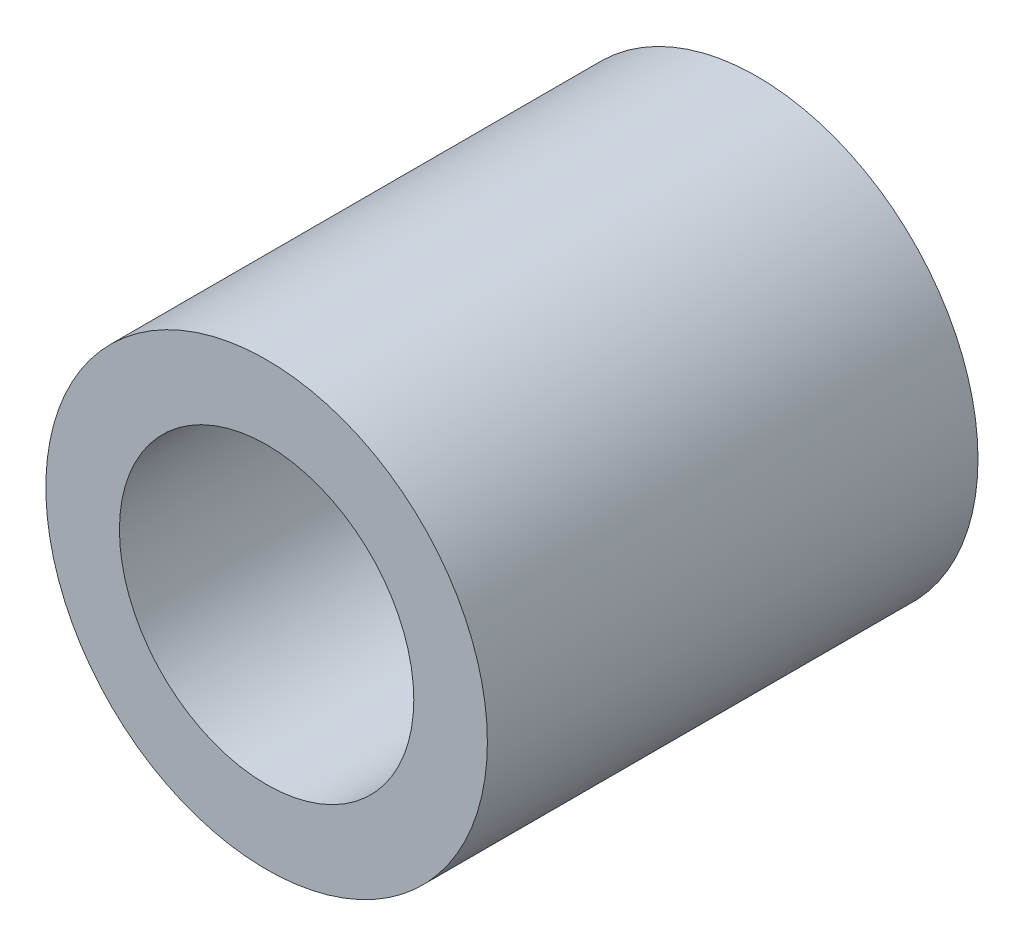
ISO-10303-21;
HEADER;
FILE_DESCRIPTION(('STEP AP214'),'2;1');
FILE_NAME('part.step','',(''),(''),'','','');
FILE_SCHEMA(('AUTOMOTIVE_DESIGN { 1 0 10303 214 1 1 1 1 }'));
ENDSEC;
DATA;
#1=APPLICATION_CONTEXT('core data for automotive mechanical design processes');
#2=APPLICATION_PROTOCOL_DEFINITION('international standard','automotive_design',2000,#1);
#3=PRODUCT_CONTEXT('',#1,'mechanical');
#4=PRODUCT('Part','Part','',(#3));
#5=PRODUCT_RELATED_PRODUCT_CATEGORY('part','',(#4));
#6=PRODUCT_DEFINITION_FORMATION('','',#4);
#7=PRODUCT_DEFINITION_CONTEXT('part definition',#1,'design');
#8=PRODUCT_DEFINITION('design','',#6,#7);
#9=PRODUCT_DEFINITION_SHAPE('','',#8);
#10=(LENGTH_UNIT() NAMED_UNIT(*) SI_UNIT(.MILLI.,.METRE.));
#11=(NAMED_UNIT(*) PLANE_ANGLE_UNIT() SI_UNIT($,.RADIAN.));
#12=(NAMED_UNIT(*) SI_UNIT($,.STERADIAN.) SOLID_ANGLE_UNIT());
#13=UNCERTAINTY_MEASURE_WITH_UNIT(LENGTH_MEASURE(1.E-05),#10,'distance_accuracy_value','');
#14=(GEOMETRIC_REPRESENTATION_CONTEXT(3) GLOBAL_UNCERTAINTY_ASSIGNED_CONTEXT((#13)) GLOBAL_UNIT_ASSIGNED_CONTEXT((#10,
#11,#12)) REPRESENTATION_CONTEXT('',''));
#15=CARTESIAN_POINT('',(0.,0.,0.));
#16=DIRECTION('',(0.,0.,1.));
#17=DIRECTION('',(1.,0.,0.));
#18=AXIS2_PLACEMENT_3D('',#15,#16,#17);
#19=CARTESIAN_POINT('',(0.,0.,10.));
#20=DIRECTION('',(0.,0.,1.));
#21=DIRECTION('',(1.,0.,0.));
#22=AXIS2_PLACEMENT_3D('',#19,#20,#21);
#23=PLANE('',#22);
#24=CARTESIAN_POINT('',(0.,0.,10.));
#25=DIRECTION('',(0.,0.,1.));
#26=DIRECTION('',(1.,0.,0.));
#27=AXIS2_PLACEMENT_3D('',#24,#25,#26);
#28=CIRCLE('',#27,4.5);
#29=CARTESIAN_POINT('',(4.5,0.,10.));
#30=VERTEX_POINT('',#29);
#31=EDGE_CURVE('E11',#30,#30,#28,.T.);
#32=ORIENTED_EDGE('',*,*,#31,.T.);
#33=EDGE_LOOP('',(#32));
#34=FACE_BOUND('',#33,.T.);
#35=CARTESIAN_POINT('',(0.,0.,10.));
#36=DIRECTION('',(0.,0.,1.));
#37=DIRECTION('',(1.,0.,0.));
#38=AXIS2_PLACEMENT_3D('',#35,#36,#37);
#39=CIRCLE('',#38,3.);
#40=CARTESIAN_POINT('',(3.,0.,10.));
#41=VERTEX_POINT('',#40);
#42=EDGE_CURVE('E52',#41,#41,#39,.T.);
#43=ORIENTED_EDGE('',*,*,#42,.F.);
#44=EDGE_LOOP('',(#43));
#45=FACE_BOUND('',#44,.T.);
#46=ADVANCED_FACE('F41',(#34,#45),#23,.T.);
#47=CARTESIAN_POINT('',(0.,0.,0.));
#48=DIRECTION('',(0.,0.,1.));
#49=DIRECTION('',(1.,0.,0.));
#50=AXIS2_PLACEMENT_3D('',#47,#48,#49);
#51=PLANE('',#50);
#52=CARTESIAN_POINT('',(0.,0.,0.));
#53=DIRECTION('',(0.,0.,1.));
#54=DIRECTION('',(1.,0.,0.));
#55=AXIS2_PLACEMENT_3D('',#52,#53,#54);
#56=CIRCLE('',#55,4.5);
#57=CARTESIAN_POINT('',(4.5,0.,0.));
#58=VERTEX_POINT('',#57);
#59=EDGE_CURVE('E45',#58,#58,#56,.T.);
#60=ORIENTED_EDGE('',*,*,#59,.F.);
#61=EDGE_LOOP('',(#60));
#62=FACE_BOUND('',#61,.T.);
#63=CARTESIAN_POINT('',(0.,0.,0.));
#64=DIRECTION('',(0.,0.,1.));
#65=DIRECTION('',(1.,0.,0.));
#66=AXIS2_PLACEMENT_3D('',#63,#64,#65);
#67=CIRCLE('',#66,3.);
#68=CARTESIAN_POINT('',(3.,0.,0.));
#69=VERTEX_POINT('',#68);
#70=EDGE_CURVE('E54',#69,#69,#67,.T.);
#71=ORIENTED_EDGE('',*,*,#70,.T.);
#72=EDGE_LOOP('',(#71));
#73=FACE_BOUND('',#72,.T.);
#74=ADVANCED_FACE('F64',(#62,#73),#51,.F.);
#75=CARTESIAN_POINT('',(0.,0.,10.));
#76=DIRECTION('',(0.,0.,-1.));
#77=DIRECTION('',(-1.,0.,0.));
#78=AXIS2_PLACEMENT_3D('',#75,#76,#77);
#79=CYLINDRICAL_SURFACE('',#78,4.5);
#80=ORIENTED_EDGE('',*,*,#31,.F.);
#81=EDGE_LOOP('',(#80));
#82=FACE_BOUND('',#81,.T.);
#83=ORIENTED_EDGE('',*,*,#59,.T.);
#84=EDGE_LOOP('',(#83));
#85=FACE_BOUND('',#84,.T.);
#86=ADVANCED_FACE('F43',(#82,#85),#79,.T.);
#87=CARTESIAN_POINT('',(0.,0.,10.));
#88=DIRECTION('',(0.,0.,-1.));
#89=DIRECTION('',(-1.,0.,0.));
#90=AXIS2_PLACEMENT_3D('',#87,#88,#89);
#91=CYLINDRICAL_SURFACE('',#90,3.);
#92=ORIENTED_EDGE('',*,*,#42,.T.);
#93=EDGE_LOOP('',(#92));
#94=FACE_BOUND('',#93,.T.);
#95=ORIENTED_EDGE('',*,*,#70,.F.);
#96=EDGE_LOOP('',(#95));
#97=FACE_BOUND('',#96,.T.);
#98=ADVANCED_FACE('F60',(#94,#97),#91,.F.);
#99=CLOSED_SHELL('',(#46,#74,#86,#98));
#100=MANIFOLD_SOLID_BREP('B2',#99);
#101=ADVANCED_BREP_SHAPE_REPRESENTATION('',(#18,#100),#14);
#102=SHAPE_DEFINITION_REPRESENTATION(#9,#101);
ENDSEC;
END-ISO-10303-21;
